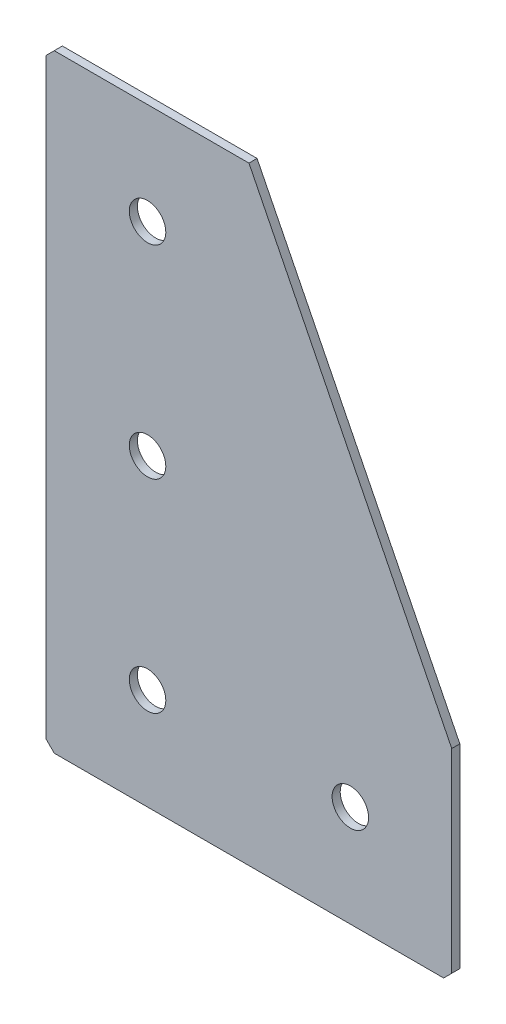
ISO-10303-21;
HEADER;
FILE_DESCRIPTION(('STEP AP214'),'2;1');
FILE_NAME('part.step','',(''),(''),'','','');
FILE_SCHEMA(('AUTOMOTIVE_DESIGN { 1 0 10303 214 1 1 1 1 }'));
ENDSEC;
DATA;
#1=APPLICATION_CONTEXT('core data for automotive mechanical design processes');
#2=APPLICATION_PROTOCOL_DEFINITION('international standard','automotive_design',2000,#1);
#3=PRODUCT_CONTEXT('',#1,'mechanical');
#4=PRODUCT('Part','Part','',(#3));
#5=PRODUCT_RELATED_PRODUCT_CATEGORY('part','',(#4));
#6=PRODUCT_DEFINITION_FORMATION('','',#4);
#7=PRODUCT_DEFINITION_CONTEXT('part definition',#1,'design');
#8=PRODUCT_DEFINITION('design','',#6,#7);
#9=PRODUCT_DEFINITION_SHAPE('','',#8);
#10=(LENGTH_UNIT() NAMED_UNIT(*) SI_UNIT(.MILLI.,.METRE.));
#11=(NAMED_UNIT(*) PLANE_ANGLE_UNIT() SI_UNIT($,.RADIAN.));
#12=(NAMED_UNIT(*) SI_UNIT($,.STERADIAN.) SOLID_ANGLE_UNIT());
#13=UNCERTAINTY_MEASURE_WITH_UNIT(LENGTH_MEASURE(1.E-05),#10,'distance_accuracy_value','');
#14=(GEOMETRIC_REPRESENTATION_CONTEXT(3) GLOBAL_UNCERTAINTY_ASSIGNED_CONTEXT((#13)) GLOBAL_UNIT_ASSIGNED_CONTEXT((#10,
#11,#12)) REPRESENTATION_CONTEXT('',''));
#15=CARTESIAN_POINT('',(0.,0.,0.));
#16=DIRECTION('',(0.,0.,1.));
#17=DIRECTION('',(1.,0.,0.));
#18=AXIS2_PLACEMENT_3D('',#15,#16,#17);
#19=CARTESIAN_POINT('',(50.,0.,-2.));
#20=DIRECTION('',(0.,-1.,0.));
#21=DIRECTION('',(1.,0.,0.));
#22=AXIS2_PLACEMENT_3D('',#19,#20,#21);
#23=PLANE('',#22);
#24=DIRECTION('',(1.,0.,0.));
#25=VECTOR('',#24,1.);
#26=CARTESIAN_POINT('',(50.,0.,-2.));
#27=LINE('',#26,#25);
#28=CARTESIAN_POINT('',(2.,0.,-2.));
#29=VERTEX_POINT('',#28);
#30=CARTESIAN_POINT('',(50.,0.,-2.));
#31=VERTEX_POINT('',#30);
#32=EDGE_CURVE('E104',#29,#31,#27,.T.);
#33=ORIENTED_EDGE('',*,*,#32,.F.);
#34=DIRECTION('',(0.,0.,1.));
#35=VECTOR('',#34,1.);
#36=CARTESIAN_POINT('',(2.,0.,-2.));
#37=LINE('',#36,#35);
#38=CARTESIAN_POINT('',(2.,0.,0.));
#39=VERTEX_POINT('',#38);
#40=EDGE_CURVE('E133',#29,#39,#37,.T.);
#41=ORIENTED_EDGE('',*,*,#40,.T.);
#42=DIRECTION('',(1.,0.,0.));
#43=VECTOR('',#42,1.);
#44=CARTESIAN_POINT('',(50.,0.,0.));
#45=LINE('',#44,#43);
#46=CARTESIAN_POINT('',(50.,0.,0.));
#47=VERTEX_POINT('',#46);
#48=EDGE_CURVE('E130',#39,#47,#45,.T.);
#49=ORIENTED_EDGE('',*,*,#48,.T.);
#50=DIRECTION('',(0.,0.,1.));
#51=VECTOR('',#50,1.);
#52=CARTESIAN_POINT('',(50.,0.,-2.));
#53=LINE('',#52,#51);
#54=EDGE_CURVE('E122',#31,#47,#53,.T.);
#55=ORIENTED_EDGE('',*,*,#54,.F.);
#56=EDGE_LOOP('',(#33,#41,#49,#55));
#57=FACE_BOUND('',#56,.T.);
#58=ADVANCED_FACE('F39',(#57),#23,.F.);
#59=CARTESIAN_POINT('',(100.,-100.,-2.));
#60=DIRECTION('',(-0.894427190999916,-0.447213595499958,0.));
#61=DIRECTION('',(0.447213595499958,-0.894427190999916,0.));
#62=AXIS2_PLACEMENT_3D('',#59,#60,#61);
#63=PLANE('',#62);
#64=DIRECTION('',(0.447213595499958,-0.894427190999916,0.));
#65=VECTOR('',#64,1.);
#66=CARTESIAN_POINT('',(100.,-100.,0.));
#67=LINE('',#66,#65);
#68=CARTESIAN_POINT('',(100.,-100.,0.));
#69=VERTEX_POINT('',#68);
#70=EDGE_CURVE('E185',#47,#69,#67,.T.);
#71=ORIENTED_EDGE('',*,*,#70,.T.);
#72=DIRECTION('',(0.,0.,1.));
#73=VECTOR('',#72,1.);
#74=CARTESIAN_POINT('',(100.,-100.,-2.));
#75=LINE('',#74,#73);
#76=CARTESIAN_POINT('',(100.,-100.,-2.));
#77=VERTEX_POINT('',#76);
#78=EDGE_CURVE('E124',#77,#69,#75,.T.);
#79=ORIENTED_EDGE('',*,*,#78,.F.);
#80=DIRECTION('',(0.447213595499958,-0.894427190999916,0.));
#81=VECTOR('',#80,1.);
#82=CARTESIAN_POINT('',(100.,-100.,-2.));
#83=LINE('',#82,#81);
#84=EDGE_CURVE('E108',#31,#77,#83,.T.);
#85=ORIENTED_EDGE('',*,*,#84,.F.);
#86=ORIENTED_EDGE('',*,*,#54,.T.);
#87=EDGE_LOOP('',(#71,#79,#85,#86));
#88=FACE_BOUND('',#87,.T.);
#89=ADVANCED_FACE('F121',(#88),#63,.F.);
#90=CARTESIAN_POINT('',(100.,-150.,-2.));
#91=DIRECTION('',(-1.,0.,0.));
#92=DIRECTION('',(0.,0.,1.));
#93=AXIS2_PLACEMENT_3D('',#90,#91,#92);
#94=PLANE('',#93);
#95=DIRECTION('',(0.,-1.,0.));
#96=VECTOR('',#95,1.);
#97=CARTESIAN_POINT('',(100.,-150.,0.));
#98=LINE('',#97,#96);
#99=CARTESIAN_POINT('',(100.,-148.,0.));
#100=VERTEX_POINT('',#99);
#101=EDGE_CURVE('E180',#69,#100,#98,.T.);
#102=ORIENTED_EDGE('',*,*,#101,.T.);
#103=DIRECTION('',(0.,0.,-1.));
#104=VECTOR('',#103,1.);
#105=CARTESIAN_POINT('',(100.,-148.,-2.));
#106=LINE('',#105,#104);
#107=CARTESIAN_POINT('',(100.,-148.,-2.));
#108=VERTEX_POINT('',#107);
#109=EDGE_CURVE('E11',#100,#108,#106,.T.);
#110=ORIENTED_EDGE('',*,*,#109,.T.);
#111=DIRECTION('',(0.,-1.,0.));
#112=VECTOR('',#111,1.);
#113=CARTESIAN_POINT('',(100.,-150.,-2.));
#114=LINE('',#113,#112);
#115=EDGE_CURVE('E127',#77,#108,#114,.T.);
#116=ORIENTED_EDGE('',*,*,#115,.F.);
#117=ORIENTED_EDGE('',*,*,#78,.T.);
#118=EDGE_LOOP('',(#102,#110,#116,#117));
#119=FACE_BOUND('',#118,.T.);
#120=ADVANCED_FACE('F263',(#119),#94,.F.);
#121=CARTESIAN_POINT('',(0.,-150.,-2.));
#122=DIRECTION('',(0.,1.,0.));
#123=DIRECTION('',(0.,0.,1.));
#124=AXIS2_PLACEMENT_3D('',#121,#122,#123);
#125=PLANE('',#124);
#126=DIRECTION('',(-1.,0.,0.));
#127=VECTOR('',#126,1.);
#128=CARTESIAN_POINT('',(0.,-150.,-2.));
#129=LINE('',#128,#127);
#130=CARTESIAN_POINT('',(98.,-150.,-2.));
#131=VERTEX_POINT('',#130);
#132=CARTESIAN_POINT('',(2.,-150.,-2.));
#133=VERTEX_POINT('',#132);
#134=EDGE_CURVE('E172',#131,#133,#129,.T.);
#135=ORIENTED_EDGE('',*,*,#134,.F.);
#136=DIRECTION('',(0.,0.,1.));
#137=VECTOR('',#136,1.);
#138=CARTESIAN_POINT('',(98.,-150.,-2.));
#139=LINE('',#138,#137);
#140=CARTESIAN_POINT('',(98.,-150.,0.));
#141=VERTEX_POINT('',#140);
#142=EDGE_CURVE('E48',#131,#141,#139,.T.);
#143=ORIENTED_EDGE('',*,*,#142,.T.);
#144=DIRECTION('',(-1.,0.,0.));
#145=VECTOR('',#144,1.);
#146=CARTESIAN_POINT('',(0.,-150.,0.));
#147=LINE('',#146,#145);
#148=CARTESIAN_POINT('',(2.,-150.,0.));
#149=VERTEX_POINT('',#148);
#150=EDGE_CURVE('E171',#141,#149,#147,.T.);
#151=ORIENTED_EDGE('',*,*,#150,.T.);
#152=DIRECTION('',(0.,0.,-1.));
#153=VECTOR('',#152,1.);
#154=CARTESIAN_POINT('',(2.,-150.,-2.));
#155=LINE('',#154,#153);
#156=EDGE_CURVE('E55',#149,#133,#155,.T.);
#157=ORIENTED_EDGE('',*,*,#156,.T.);
#158=EDGE_LOOP('',(#135,#143,#151,#157));
#159=FACE_BOUND('',#158,.T.);
#160=ADVANCED_FACE('F170',(#159),#125,.F.);
#161=CARTESIAN_POINT('',(0.,0.,-2.));
#162=DIRECTION('',(1.,0.,0.));
#163=DIRECTION('',(0.,0.,-1.));
#164=AXIS2_PLACEMENT_3D('',#161,#162,#163);
#165=PLANE('',#164);
#166=DIRECTION('',(0.,1.,0.));
#167=VECTOR('',#166,1.);
#168=CARTESIAN_POINT('',(0.,0.,0.));
#169=LINE('',#168,#167);
#170=CARTESIAN_POINT('',(0.,-148.,0.));
#171=VERTEX_POINT('',#170);
#172=CARTESIAN_POINT('',(0.,-2.,0.));
#173=VERTEX_POINT('',#172);
#174=EDGE_CURVE('E117',#171,#173,#169,.T.);
#175=ORIENTED_EDGE('',*,*,#174,.T.);
#176=DIRECTION('',(0.,0.,-1.));
#177=VECTOR('',#176,1.);
#178=CARTESIAN_POINT('',(0.,-2.,-2.));
#179=LINE('',#178,#177);
#180=CARTESIAN_POINT('',(0.,-2.,-2.));
#181=VERTEX_POINT('',#180);
#182=EDGE_CURVE('E155',#173,#181,#179,.T.);
#183=ORIENTED_EDGE('',*,*,#182,.T.);
#184=DIRECTION('',(0.,1.,0.));
#185=VECTOR('',#184,1.);
#186=CARTESIAN_POINT('',(0.,0.,-2.));
#187=LINE('',#186,#185);
#188=CARTESIAN_POINT('',(0.,-148.,-2.));
#189=VERTEX_POINT('',#188);
#190=EDGE_CURVE('E139',#189,#181,#187,.T.);
#191=ORIENTED_EDGE('',*,*,#190,.F.);
#192=DIRECTION('',(0.,0.,1.));
#193=VECTOR('',#192,1.);
#194=CARTESIAN_POINT('',(0.,-148.,-2.));
#195=LINE('',#194,#193);
#196=EDGE_CURVE('E151',#189,#171,#195,.T.);
#197=ORIENTED_EDGE('',*,*,#196,.T.);
#198=EDGE_LOOP('',(#175,#183,#191,#197));
#199=FACE_BOUND('',#198,.T.);
#200=ADVANCED_FACE('F235',(#199),#165,.F.);
#201=CARTESIAN_POINT('',(0.,0.,-2.));
#202=DIRECTION('',(0.,0.,1.));
#203=DIRECTION('',(1.,0.,0.));
#204=AXIS2_PLACEMENT_3D('',#201,#202,#203);
#205=PLANE('',#204);
#206=CARTESIAN_POINT('',(75.,-125.,-2.00000000000001));
#207=DIRECTION('',(0.,0.,-1.));
#208=DIRECTION('',(0.,1.,0.));
#209=AXIS2_PLACEMENT_3D('',#206,#207,#208);
#210=CIRCLE('',#209,4.5);
#211=CARTESIAN_POINT('',(75.,-120.5,-2.00000000000001));
#212=VERTEX_POINT('',#211);
#213=EDGE_CURVE('E226',#212,#212,#210,.T.);
#214=ORIENTED_EDGE('',*,*,#213,.F.);
#215=EDGE_LOOP('',(#214));
#216=FACE_BOUND('',#215,.T.);
#217=CARTESIAN_POINT('',(25.,-125.,-2.00000000000001));
#218=DIRECTION('',(0.,0.,-1.));
#219=DIRECTION('',(0.,1.,0.));
#220=AXIS2_PLACEMENT_3D('',#217,#218,#219);
#221=CIRCLE('',#220,4.5);
#222=CARTESIAN_POINT('',(25.,-120.5,-2.00000000000001));
#223=VERTEX_POINT('',#222);
#224=EDGE_CURVE('E218',#223,#223,#221,.T.);
#225=ORIENTED_EDGE('',*,*,#224,.F.);
#226=EDGE_LOOP('',(#225));
#227=FACE_BOUND('',#226,.T.);
#228=CARTESIAN_POINT('',(25.,-75.,-2.));
#229=DIRECTION('',(0.,0.,-1.));
#230=DIRECTION('',(0.,1.,0.));
#231=AXIS2_PLACEMENT_3D('',#228,#229,#230);
#232=CIRCLE('',#231,4.5);
#233=CARTESIAN_POINT('',(25.,-70.5,-2.));
#234=VERTEX_POINT('',#233);
#235=EDGE_CURVE('E210',#234,#234,#232,.T.);
#236=ORIENTED_EDGE('',*,*,#235,.F.);
#237=EDGE_LOOP('',(#236));
#238=FACE_BOUND('',#237,.T.);
#239=CARTESIAN_POINT('',(25.,-25.,-2.));
#240=DIRECTION('',(0.,0.,-1.));
#241=DIRECTION('',(0.,1.,0.));
#242=AXIS2_PLACEMENT_3D('',#239,#240,#241);
#243=CIRCLE('',#242,4.5);
#244=CARTESIAN_POINT('',(25.,-20.5,-2.));
#245=VERTEX_POINT('',#244);
#246=EDGE_CURVE('E202',#245,#245,#243,.T.);
#247=ORIENTED_EDGE('',*,*,#246,.F.);
#248=EDGE_LOOP('',(#247));
#249=FACE_BOUND('',#248,.T.);
#250=ORIENTED_EDGE('',*,*,#190,.T.);
#251=DIRECTION('',(-0.707106781186548,-0.707106781186548,0.));
#252=VECTOR('',#251,1.);
#253=CARTESIAN_POINT('',(2.,0.,-2.));
#254=LINE('',#253,#252);
#255=EDGE_CURVE('E111',#181,#29,#254,.F.);
#256=ORIENTED_EDGE('',*,*,#255,.T.);
#257=ORIENTED_EDGE('',*,*,#32,.T.);
#258=ORIENTED_EDGE('',*,*,#84,.T.);
#259=ORIENTED_EDGE('',*,*,#115,.T.);
#260=DIRECTION('',(0.707106781186548,0.707106781186548,0.));
#261=VECTOR('',#260,1.);
#262=CARTESIAN_POINT('',(98.,-150.,-2.));
#263=LINE('',#262,#261);
#264=EDGE_CURVE('E62',#108,#131,#263,.F.);
#265=ORIENTED_EDGE('',*,*,#264,.T.);
#266=ORIENTED_EDGE('',*,*,#134,.T.);
#267=DIRECTION('',(0.707106781186548,-0.707106781186548,0.));
#268=VECTOR('',#267,1.);
#269=CARTESIAN_POINT('',(0.,-148.,-2.));
#270=LINE('',#269,#268);
#271=EDGE_CURVE('E158',#133,#189,#270,.F.);
#272=ORIENTED_EDGE('',*,*,#271,.T.);
#273=EDGE_LOOP('',(#250,#256,#257,#258,#259,#265,#266,#272));
#274=FACE_BOUND('',#273,.T.);
#275=ADVANCED_FACE('F107',(#216,#227,#238,#249,#274),#205,.F.);
#276=CARTESIAN_POINT('',(0.,0.,0.));
#277=DIRECTION('',(0.,0.,1.));
#278=DIRECTION('',(1.,0.,0.));
#279=AXIS2_PLACEMENT_3D('',#276,#277,#278);
#280=PLANE('',#279);
#281=CARTESIAN_POINT('',(75.,-125.,0.));
#282=DIRECTION('',(0.,0.,-1.));
#283=DIRECTION('',(0.,1.,0.));
#284=AXIS2_PLACEMENT_3D('',#281,#282,#283);
#285=CIRCLE('',#284,4.5);
#286=CARTESIAN_POINT('',(75.,-120.5,0.));
#287=VERTEX_POINT('',#286);
#288=EDGE_CURVE('E222',#287,#287,#285,.T.);
#289=ORIENTED_EDGE('',*,*,#288,.T.);
#290=EDGE_LOOP('',(#289));
#291=FACE_BOUND('',#290,.T.);
#292=CARTESIAN_POINT('',(25.,-125.,0.));
#293=DIRECTION('',(0.,0.,-1.));
#294=DIRECTION('',(0.,1.,0.));
#295=AXIS2_PLACEMENT_3D('',#292,#293,#294);
#296=CIRCLE('',#295,4.5);
#297=CARTESIAN_POINT('',(25.,-120.5,0.));
#298=VERTEX_POINT('',#297);
#299=EDGE_CURVE('E214',#298,#298,#296,.T.);
#300=ORIENTED_EDGE('',*,*,#299,.T.);
#301=EDGE_LOOP('',(#300));
#302=FACE_BOUND('',#301,.T.);
#303=CARTESIAN_POINT('',(25.,-75.,0.));
#304=DIRECTION('',(0.,0.,-1.));
#305=DIRECTION('',(0.,1.,0.));
#306=AXIS2_PLACEMENT_3D('',#303,#304,#305);
#307=CIRCLE('',#306,4.5);
#308=CARTESIAN_POINT('',(25.,-70.5,0.));
#309=VERTEX_POINT('',#308);
#310=EDGE_CURVE('E206',#309,#309,#307,.T.);
#311=ORIENTED_EDGE('',*,*,#310,.T.);
#312=EDGE_LOOP('',(#311));
#313=FACE_BOUND('',#312,.T.);
#314=CARTESIAN_POINT('',(25.,-25.,0.));
#315=DIRECTION('',(0.,0.,-1.));
#316=DIRECTION('',(0.,1.,0.));
#317=AXIS2_PLACEMENT_3D('',#314,#315,#316);
#318=CIRCLE('',#317,4.5);
#319=CARTESIAN_POINT('',(25.,-20.5,0.));
#320=VERTEX_POINT('',#319);
#321=EDGE_CURVE('E192',#320,#320,#318,.T.);
#322=ORIENTED_EDGE('',*,*,#321,.T.);
#323=EDGE_LOOP('',(#322));
#324=FACE_BOUND('',#323,.T.);
#325=ORIENTED_EDGE('',*,*,#48,.F.);
#326=DIRECTION('',(0.707106781186548,0.707106781186548,0.));
#327=VECTOR('',#326,1.);
#328=CARTESIAN_POINT('',(1.,-1.,0.));
#329=LINE('',#328,#327);
#330=EDGE_CURVE('E148',#39,#173,#329,.F.);
#331=ORIENTED_EDGE('',*,*,#330,.T.);
#332=ORIENTED_EDGE('',*,*,#174,.F.);
#333=DIRECTION('',(-0.707106781186548,0.707106781186548,0.));
#334=VECTOR('',#333,1.);
#335=CARTESIAN_POINT('',(-74.,-74.,0.));
#336=LINE('',#335,#334);
#337=EDGE_CURVE('E137',#171,#149,#336,.F.);
#338=ORIENTED_EDGE('',*,*,#337,.T.);
#339=ORIENTED_EDGE('',*,*,#150,.F.);
#340=DIRECTION('',(-0.707106781186548,-0.707106781186548,0.));
#341=VECTOR('',#340,1.);
#342=CARTESIAN_POINT('',(124.,-124.,0.));
#343=LINE('',#342,#341);
#344=EDGE_CURVE('E145',#141,#100,#343,.F.);
#345=ORIENTED_EDGE('',*,*,#344,.T.);
#346=ORIENTED_EDGE('',*,*,#101,.F.);
#347=ORIENTED_EDGE('',*,*,#70,.F.);
#348=EDGE_LOOP('',(#325,#331,#332,#338,#339,#345,#346,#347));
#349=FACE_BOUND('',#348,.T.);
#350=ADVANCED_FACE('F175',(#291,#302,#313,#324,#349),#280,.T.);
#351=CARTESIAN_POINT('',(25.,-25.,-2.));
#352=DIRECTION('',(0.,0.,-1.));
#353=DIRECTION('',(0.,1.,0.));
#354=AXIS2_PLACEMENT_3D('',#351,#352,#353);
#355=CYLINDRICAL_SURFACE('',#354,4.5);
#356=ORIENTED_EDGE('',*,*,#321,.F.);
#357=EDGE_LOOP('',(#356));
#358=FACE_BOUND('',#357,.T.);
#359=ORIENTED_EDGE('',*,*,#246,.T.);
#360=EDGE_LOOP('',(#359));
#361=FACE_BOUND('',#360,.T.);
#362=ADVANCED_FACE('F243',(#358,#361),#355,.F.);
#363=CARTESIAN_POINT('',(25.,-75.,-2.));
#364=DIRECTION('',(0.,0.,-1.));
#365=DIRECTION('',(0.,1.,0.));
#366=AXIS2_PLACEMENT_3D('',#363,#364,#365);
#367=CYLINDRICAL_SURFACE('',#366,4.5);
#368=ORIENTED_EDGE('',*,*,#310,.F.);
#369=EDGE_LOOP('',(#368));
#370=FACE_BOUND('',#369,.T.);
#371=ORIENTED_EDGE('',*,*,#235,.T.);
#372=EDGE_LOOP('',(#371));
#373=FACE_BOUND('',#372,.T.);
#374=ADVANCED_FACE('F245',(#370,#373),#367,.F.);
#375=CARTESIAN_POINT('',(25.,-125.,-2.00000000000001));
#376=DIRECTION('',(0.,0.,-1.));
#377=DIRECTION('',(0.,1.,0.));
#378=AXIS2_PLACEMENT_3D('',#375,#376,#377);
#379=CYLINDRICAL_SURFACE('',#378,4.5);
#380=ORIENTED_EDGE('',*,*,#299,.F.);
#381=EDGE_LOOP('',(#380));
#382=FACE_BOUND('',#381,.T.);
#383=ORIENTED_EDGE('',*,*,#224,.T.);
#384=EDGE_LOOP('',(#383));
#385=FACE_BOUND('',#384,.T.);
#386=ADVANCED_FACE('F252',(#382,#385),#379,.F.);
#387=CARTESIAN_POINT('',(75.,-125.,-2.00000000000001));
#388=DIRECTION('',(0.,0.,-1.));
#389=DIRECTION('',(0.,1.,0.));
#390=AXIS2_PLACEMENT_3D('',#387,#388,#389);
#391=CYLINDRICAL_SURFACE('',#390,4.5);
#392=ORIENTED_EDGE('',*,*,#288,.F.);
#393=EDGE_LOOP('',(#392));
#394=FACE_BOUND('',#393,.T.);
#395=ORIENTED_EDGE('',*,*,#213,.T.);
#396=EDGE_LOOP('',(#395));
#397=FACE_BOUND('',#396,.T.);
#398=ADVANCED_FACE('F231',(#394,#397),#391,.F.);
#399=CARTESIAN_POINT('',(2.,0.,-2.));
#400=DIRECTION('',(0.707106781186547,-0.707106781186547,0.));
#401=DIRECTION('',(0.,0.,1.));
#402=AXIS2_PLACEMENT_3D('',#399,#400,#401);
#403=PLANE('',#402);
#404=ORIENTED_EDGE('',*,*,#255,.F.);
#405=ORIENTED_EDGE('',*,*,#182,.F.);
#406=ORIENTED_EDGE('',*,*,#330,.F.);
#407=ORIENTED_EDGE('',*,*,#40,.F.);
#408=EDGE_LOOP('',(#404,#405,#406,#407));
#409=FACE_BOUND('',#408,.T.);
#410=ADVANCED_FACE('F267',(#409),#403,.F.);
#411=CARTESIAN_POINT('',(98.,-150.,-2.));
#412=DIRECTION('',(-0.707106781186547,0.707106781186547,0.));
#413=DIRECTION('',(0.,0.,1.));
#414=AXIS2_PLACEMENT_3D('',#411,#412,#413);
#415=PLANE('',#414);
#416=ORIENTED_EDGE('',*,*,#264,.F.);
#417=ORIENTED_EDGE('',*,*,#109,.F.);
#418=ORIENTED_EDGE('',*,*,#344,.F.);
#419=ORIENTED_EDGE('',*,*,#142,.F.);
#420=EDGE_LOOP('',(#416,#417,#418,#419));
#421=FACE_BOUND('',#420,.T.);
#422=ADVANCED_FACE('F269',(#421),#415,.F.);
#423=CARTESIAN_POINT('',(0.,-148.,-2.));
#424=DIRECTION('',(0.707106781186547,0.707106781186547,0.));
#425=DIRECTION('',(0.,0.,1.));
#426=AXIS2_PLACEMENT_3D('',#423,#424,#425);
#427=PLANE('',#426);
#428=ORIENTED_EDGE('',*,*,#271,.F.);
#429=ORIENTED_EDGE('',*,*,#156,.F.);
#430=ORIENTED_EDGE('',*,*,#337,.F.);
#431=ORIENTED_EDGE('',*,*,#196,.F.);
#432=EDGE_LOOP('',(#428,#429,#430,#431));
#433=FACE_BOUND('',#432,.T.);
#434=ADVANCED_FACE('F41',(#433),#427,.F.);
#435=CLOSED_SHELL('',(#58,#89,#120,#160,#200,#275,#350,#362,#374,#386,#398,#410,#422,#434));
#436=MANIFOLD_SOLID_BREP('B2',#435);
#437=ADVANCED_BREP_SHAPE_REPRESENTATION('',(#18,#436),#14);
#438=SHAPE_DEFINITION_REPRESENTATION(#9,#437);
ENDSEC;
END-ISO-10303-21;
